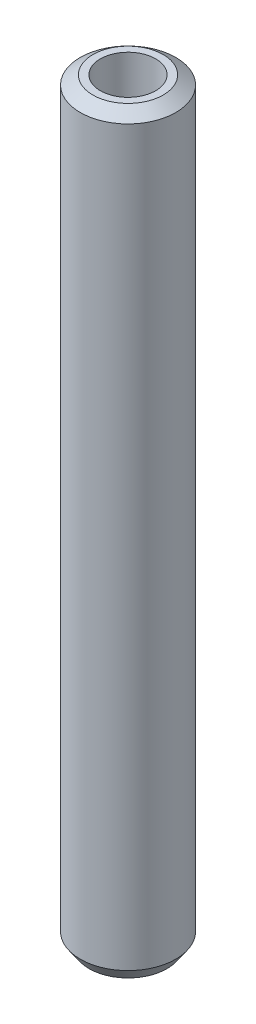
ISO-10303-21;
HEADER;
FILE_DESCRIPTION(('STEP AP214'),'2;1');
FILE_NAME('part.step','',(''),(''),'','','');
FILE_SCHEMA(('AUTOMOTIVE_DESIGN { 1 0 10303 214 1 1 1 1 }'));
ENDSEC;
DATA;
#1=APPLICATION_CONTEXT('core data for automotive mechanical design processes');
#2=APPLICATION_PROTOCOL_DEFINITION('international standard','automotive_design',2000,#1);
#3=PRODUCT_CONTEXT('',#1,'mechanical');
#4=PRODUCT('Part','Part','',(#3));
#5=PRODUCT_RELATED_PRODUCT_CATEGORY('part','',(#4));
#6=PRODUCT_DEFINITION_FORMATION('','',#4);
#7=PRODUCT_DEFINITION_CONTEXT('part definition',#1,'design');
#8=PRODUCT_DEFINITION('design','',#6,#7);
#9=PRODUCT_DEFINITION_SHAPE('','',#8);
#10=(LENGTH_UNIT() NAMED_UNIT(*) SI_UNIT(.MILLI.,.METRE.));
#11=(NAMED_UNIT(*) PLANE_ANGLE_UNIT() SI_UNIT($,.RADIAN.));
#12=(NAMED_UNIT(*) SI_UNIT($,.STERADIAN.) SOLID_ANGLE_UNIT());
#13=UNCERTAINTY_MEASURE_WITH_UNIT(LENGTH_MEASURE(1.E-05),#10,'distance_accuracy_value','');
#14=(GEOMETRIC_REPRESENTATION_CONTEXT(3) GLOBAL_UNCERTAINTY_ASSIGNED_CONTEXT((#13)) GLOBAL_UNIT_ASSIGNED_CONTEXT((#10,
#11,#12)) REPRESENTATION_CONTEXT('',''));
#15=CARTESIAN_POINT('',(0.,0.,0.));
#16=DIRECTION('',(0.,0.,1.));
#17=DIRECTION('',(1.,0.,0.));
#18=AXIS2_PLACEMENT_3D('',#15,#16,#17);
#19=CARTESIAN_POINT('',(0.,197.476012914103,0.));
#20=DIRECTION('',(0.,-1.,0.));
#21=DIRECTION('',(0.,0.,-1.));
#22=AXIS2_PLACEMENT_3D('',#19,#20,#21);
#23=CYLINDRICAL_SURFACE('',#22,12.5);
#24=CARTESIAN_POINT('',(0.,195.169636921624,0.));
#25=DIRECTION('',(0.,1.,0.));
#26=DIRECTION('',(0.,0.,1.));
#27=AXIS2_PLACEMENT_3D('',#24,#25,#26);
#28=CIRCLE('',#27,12.5);
#29=CARTESIAN_POINT('',(0.,195.169636921624,-12.5));
#30=VERTEX_POINT('',#29);
#31=EDGE_CURVE('E50',#30,#30,#28,.F.);
#32=CARTESIAN_POINT('',(0.,3.31130484003073,0.));
#33=DIRECTION('',(0.,1.,0.));
#34=DIRECTION('',(0.,0.,1.));
#35=AXIS2_PLACEMENT_3D('',#32,#33,#34);
#36=CIRCLE('',#35,12.5);
#37=CARTESIAN_POINT('',(0.,3.31130484003073,-12.5));
#38=VERTEX_POINT('',#37);
#39=EDGE_CURVE('E51',#38,#38,#36,.T.);
#40=CARTESIAN_POINT('',(0.,195.169636921624,-12.5));
#41=CARTESIAN_POINT('',(0.,193.171112629107,-12.5));
#42=CARTESIAN_POINT('',(0.,191.172588336591,-12.5));
#43=CARTESIAN_POINT('',(0.,187.175539751557,-12.5));
#44=CARTESIAN_POINT('',(0.,185.177015459041,-12.5));
#45=CARTESIAN_POINT('',(0.,181.179966874008,-12.5));
#46=CARTESIAN_POINT('',(0.,179.181442581491,-12.5));
#47=CARTESIAN_POINT('',(0.,175.184393996458,-12.5));
#48=CARTESIAN_POINT('',(0.,173.185869703941,-12.5));
#49=CARTESIAN_POINT('',(0.,169.188821118908,-12.5));
#50=CARTESIAN_POINT('',(0.,167.190296826391,-12.5));
#51=CARTESIAN_POINT('',(0.,163.193248241358,-12.5));
#52=CARTESIAN_POINT('',(0.,161.194723948842,-12.5));
#53=CARTESIAN_POINT('',(0.,157.197675363808,-12.5));
#54=CARTESIAN_POINT('',(0.,155.199151071292,-12.5));
#55=CARTESIAN_POINT('',(0.,151.202102486259,-12.5));
#56=CARTESIAN_POINT('',(0.,149.203578193742,-12.5));
#57=CARTESIAN_POINT('',(0.,145.206529608709,-12.5));
#58=CARTESIAN_POINT('',(0.,143.208005316192,-12.5));
#59=CARTESIAN_POINT('',(0.,139.210956731159,-12.5));
#60=CARTESIAN_POINT('',(0.,137.212432438643,-12.5));
#61=CARTESIAN_POINT('',(0.,133.215383853609,-12.5));
#62=CARTESIAN_POINT('',(0.,131.216859561093,-12.5));
#63=CARTESIAN_POINT('',(0.,127.21981097606,-12.5));
#64=CARTESIAN_POINT('',(0.,125.221286683543,-12.5));
#65=CARTESIAN_POINT('',(0.,121.22423809851,-12.5));
#66=CARTESIAN_POINT('',(0.,119.225713805993,-12.5));
#67=CARTESIAN_POINT('',(0.,115.22866522096,-12.5));
#68=CARTESIAN_POINT('',(0.,113.230140928443,-12.5));
#69=CARTESIAN_POINT('',(0.,109.23309234341,-12.5));
#70=CARTESIAN_POINT('',(0.,107.234568050894,-12.5));
#71=CARTESIAN_POINT('',(0.,103.23751946586,-12.5));
#72=CARTESIAN_POINT('',(0.,101.238995173344,-12.5));
#73=CARTESIAN_POINT('',(0.,97.2419465883106,-12.5));
#74=CARTESIAN_POINT('',(0.,95.243422295794,-12.5));
#75=CARTESIAN_POINT('',(0.,91.2463737107608,-12.5));
#76=CARTESIAN_POINT('',(0.,89.2478494182442,-12.5));
#77=CARTESIAN_POINT('',(0.,85.2508008332111,-12.5));
#78=CARTESIAN_POINT('',(0.,83.2522765406945,-12.5));
#79=CARTESIAN_POINT('',(0.,79.2552279556613,-12.5));
#80=CARTESIAN_POINT('',(0.,77.2567036631447,-12.5));
#81=CARTESIAN_POINT('',(0.,73.2596550781115,-12.5));
#82=CARTESIAN_POINT('',(0.,71.2611307855949,-12.5));
#83=CARTESIAN_POINT('',(0.,67.2640822005617,-12.5));
#84=CARTESIAN_POINT('',(0.,65.2655579080451,-12.5));
#85=CARTESIAN_POINT('',(0.,61.2685093230119,-12.5));
#86=CARTESIAN_POINT('',(0.,59.2699850304953,-12.5));
#87=CARTESIAN_POINT('',(0.,55.2729364454621,-12.5));
#88=CARTESIAN_POINT('',(0.,53.2744121529456,-12.5));
#89=CARTESIAN_POINT('',(0.,49.2773635679124,-12.5));
#90=CARTESIAN_POINT('',(0.,47.2788392753958,-12.5));
#91=CARTESIAN_POINT('',(0.,43.2817906903626,-12.5));
#92=CARTESIAN_POINT('',(0.,41.283266397846,-12.5));
#93=CARTESIAN_POINT('',(0.,37.2862178128128,-12.5));
#94=CARTESIAN_POINT('',(0.,35.2876935202962,-12.5));
#95=CARTESIAN_POINT('',(0.,31.290644935263,-12.5));
#96=CARTESIAN_POINT('',(0.,29.2921206427464,-12.5));
#97=CARTESIAN_POINT('',(0.,25.2950720577132,-12.5));
#98=CARTESIAN_POINT('',(0.,23.2965477651966,-12.5));
#99=CARTESIAN_POINT('',(0.,19.2994991801635,-12.5));
#100=CARTESIAN_POINT('',(0.,17.3009748876469,-12.5));
#101=CARTESIAN_POINT('',(0.,13.3039263026137,-12.5));
#102=CARTESIAN_POINT('',(0.,11.3054020100971,-12.5));
#103=CARTESIAN_POINT('',(0.,7.3083534250639,-12.5));
#104=CARTESIAN_POINT('',(0.,5.30982913254731,-12.5));
#105=CARTESIAN_POINT('',(0.,3.31130484003073,-12.5));
#106=B_SPLINE_CURVE_WITH_KNOTS('',3,(#40,#41,#42,#43,#44,#45,#46,#47,#48,#49,#50,#51,#52,#53,
#54,#55,#56,#57,#58,#59,#60,#61,#62,#63,#64,#65,#66,#67,#68,#69,#70,#71,#72,#73,#74,#75,#76,#77,
#78,#79,#80,#81,#82,#83,#84,#85,#86,#87,#88,#89,#90,#91,#92,#93,#94,#95,#96,#97,#98,#99,#100,
#101,#102,#103,#104,#105),.UNSPECIFIED.,.F.,.F.,(4,2,2,2,2,2,2,2,2,2,2,2,2,2,2,2,2,2,2,2,2,2,2,
2,2,2,2,2,2,2,2,2,4),(0.,5.99557287754979,11.9911457550996,17.9867186326494,23.9822915101992,
29.9778643877489,35.9734372652987,41.9690101428485,47.9645830203983,53.960155897948,
59.9557287754978,65.9513016530476,71.9468745305974,77.9424474081472,83.938020285697,
89.9335931632467,95.9291660407965,101.924738918346,107.920311795896,113.915884673446,
119.911457550996,125.907030428545,131.902603306095,137.898176183645,143.893749061195,
149.889321938745,155.884894816294,161.880467693844,167.876040571394,173.871613448944,
179.867186326493,185.862759204043,191.858332081593),.UNSPECIFIED.);
#107=EDGE_CURVE('BSEAM39',#30,#38,#106,.T.);
#108=ORIENTED_EDGE('',*,*,#31,.T.);
#109=ORIENTED_EDGE('',*,*,#39,.T.);
#110=ORIENTED_EDGE('',*,*,#107,.T.);
#111=ORIENTED_EDGE('',*,*,#107,.F.);
#112=EDGE_LOOP('',(#108,#110,#109,#111));
#113=FACE_BOUND('',#112,.T.);
#114=ADVANCED_FACE('F39',(#113),#23,.T.);
#115=CARTESIAN_POINT('',(0.,197.476012914103,0.));
#116=DIRECTION('',(0.,1.,0.));
#117=DIRECTION('',(0.,0.,1.));
#118=AXIS2_PLACEMENT_3D('',#115,#116,#117);
#119=PLANE('',#118);
#120=CARTESIAN_POINT('',(0.,197.476012914103,0.));
#121=DIRECTION('',(0.,1.,0.));
#122=DIRECTION('',(0.,0.,1.));
#123=AXIS2_PLACEMENT_3D('',#120,#121,#122);
#124=CIRCLE('',#123,9.18869515996967);
#125=CARTESIAN_POINT('',(0.,197.476012914103,9.18869515996967));
#126=VERTEX_POINT('',#125);
#127=EDGE_CURVE('E54',#126,#126,#124,.T.);
#128=ORIENTED_EDGE('',*,*,#127,.T.);
#129=EDGE_LOOP('',(#128));
#130=FACE_BOUND('',#129,.T.);
#131=CARTESIAN_POINT('',(0.,197.476012914103,0.));
#132=DIRECTION('',(0.,1.,0.));
#133=DIRECTION('',(0.,0.,1.));
#134=AXIS2_PLACEMENT_3D('',#131,#132,#133);
#135=CIRCLE('',#134,7.23894192214689);
#136=CARTESIAN_POINT('',(0.,197.476012914103,-7.23894192214689));
#137=VERTEX_POINT('',#136);
#138=EDGE_CURVE('E58',#137,#137,#135,.T.);
#139=ORIENTED_EDGE('',*,*,#138,.F.);
#140=EDGE_LOOP('',(#139));
#141=FACE_BOUND('',#140,.T.);
#142=ADVANCED_FACE('F69',(#130,#141),#119,.T.);
#143=CARTESIAN_POINT('',(0.,0.,0.));
#144=DIRECTION('',(0.,1.,0.));
#145=DIRECTION('',(0.,0.,1.));
#146=AXIS2_PLACEMENT_3D('',#143,#144,#145);
#147=PLANE('',#146);
#148=CARTESIAN_POINT('',(0.,0.,0.));
#149=DIRECTION('',(0.,1.,0.));
#150=DIRECTION('',(0.,0.,1.));
#151=AXIS2_PLACEMENT_3D('',#148,#149,#150);
#152=CIRCLE('',#151,10.1936240075203);
#153=CARTESIAN_POINT('',(0.,0.,10.1936240075203));
#154=VERTEX_POINT('',#153);
#155=EDGE_CURVE('E10',#154,#154,#152,.F.);
#156=ORIENTED_EDGE('',*,*,#155,.T.);
#157=EDGE_LOOP('',(#156));
#158=FACE_BOUND('',#157,.T.);
#159=CARTESIAN_POINT('',(0.,0.,0.));
#160=DIRECTION('',(0.,1.,0.));
#161=DIRECTION('',(0.,0.,1.));
#162=AXIS2_PLACEMENT_3D('',#159,#160,#161);
#163=CIRCLE('',#162,7.23894192214689);
#164=CARTESIAN_POINT('',(0.,0.,-7.23894192214689));
#165=VERTEX_POINT('',#164);
#166=EDGE_CURVE('E63',#165,#165,#163,.T.);
#167=ORIENTED_EDGE('',*,*,#166,.T.);
#168=EDGE_LOOP('',(#167));
#169=FACE_BOUND('',#168,.T.);
#170=ADVANCED_FACE('F75',(#158,#169),#147,.F.);
#171=CARTESIAN_POINT('',(0.,197.476012914103,0.));
#172=DIRECTION('',(0.,-1.,0.));
#173=DIRECTION('',(0.,0.,-1.));
#174=AXIS2_PLACEMENT_3D('',#171,#172,#173);
#175=CYLINDRICAL_SURFACE('',#174,7.23894192214689);
#176=CARTESIAN_POINT('',(0.,197.476012914103,-7.23894192214689));
#177=CARTESIAN_POINT('',(0.,195.418971112915,-7.23894192214689));
#178=CARTESIAN_POINT('',(0.,193.361929311726,-7.23894192214689));
#179=CARTESIAN_POINT('',(0.,189.247845709349,-7.23894192214689));
#180=CARTESIAN_POINT('',(0.,187.19080390816,-7.23894192214689));
#181=CARTESIAN_POINT('',(0.,183.076720305783,-7.23894192214689));
#182=CARTESIAN_POINT('',(0.,181.019678504595,-7.23894192214689));
#183=CARTESIAN_POINT('',(0.,176.905594902217,-7.23894192214689));
#184=CARTESIAN_POINT('',(0.,174.848553101029,-7.23894192214689));
#185=CARTESIAN_POINT('',(0.,170.734469498652,-7.23894192214689));
#186=CARTESIAN_POINT('',(0.,168.677427697463,-7.23894192214689));
#187=CARTESIAN_POINT('',(0.,164.563344095086,-7.23894192214689));
#188=CARTESIAN_POINT('',(0.,162.506302293897,-7.23894192214689));
#189=CARTESIAN_POINT('',(0.,158.39221869152,-7.23894192214689));
#190=CARTESIAN_POINT('',(0.,156.335176890332,-7.23894192214689));
#191=CARTESIAN_POINT('',(0.,152.221093287954,-7.23894192214689));
#192=CARTESIAN_POINT('',(0.,150.164051486766,-7.23894192214689));
#193=CARTESIAN_POINT('',(0.,146.049967884389,-7.23894192214689));
#194=CARTESIAN_POINT('',(0.,143.9929260832,-7.23894192214689));
#195=CARTESIAN_POINT('',(0.,139.878842480823,-7.23894192214689));
#196=CARTESIAN_POINT('',(0.,137.821800679634,-7.23894192214689));
#197=CARTESIAN_POINT('',(0.,133.707717077257,-7.23894192214689));
#198=CARTESIAN_POINT('',(0.,131.650675276069,-7.23894192214689));
#199=CARTESIAN_POINT('',(0.,127.536591673692,-7.23894192214689));
#200=CARTESIAN_POINT('',(0.,125.479549872503,-7.23894192214689));
#201=CARTESIAN_POINT('',(0.,121.365466270126,-7.23894192214689));
#202=CARTESIAN_POINT('',(0.,119.308424468937,-7.23894192214689));
#203=CARTESIAN_POINT('',(0.,115.19434086656,-7.23894192214689));
#204=CARTESIAN_POINT('',(0.,113.137299065372,-7.23894192214689));
#205=CARTESIAN_POINT('',(0.,109.023215462994,-7.23894192214689));
#206=CARTESIAN_POINT('',(0.,106.966173661806,-7.23894192214689));
#207=CARTESIAN_POINT('',(0.,102.852090059429,-7.23894192214689));
#208=CARTESIAN_POINT('',(0.,100.79504825824,-7.23894192214689));
#209=CARTESIAN_POINT('',(0.,96.680964655863,-7.23894192214689));
#210=CARTESIAN_POINT('',(0.,94.6239228546744,-7.23894192214689));
#211=CARTESIAN_POINT('',(0.,90.5098392522973,-7.23894192214689));
#212=CARTESIAN_POINT('',(0.,88.4527974511087,-7.23894192214689));
#213=CARTESIAN_POINT('',(0.,84.3387138487315,-7.23894192214689));
#214=CARTESIAN_POINT('',(0.,82.281672047543,-7.23894192214689));
#215=CARTESIAN_POINT('',(0.,78.1675884451658,-7.23894192214689));
#216=CARTESIAN_POINT('',(0.,76.1105466439772,-7.23894192214689));
#217=CARTESIAN_POINT('',(0.,71.9964630416001,-7.23894192214689));
#218=CARTESIAN_POINT('',(0.,69.9394212404115,-7.23894192214689));
#219=CARTESIAN_POINT('',(0.,65.8253376380344,-7.23894192214689));
#220=CARTESIAN_POINT('',(0.,63.7682958368458,-7.23894192214689));
#221=CARTESIAN_POINT('',(0.,59.6542122344687,-7.23894192214689));
#222=CARTESIAN_POINT('',(0.,57.5971704332801,-7.23894192214689));
#223=CARTESIAN_POINT('',(0.,53.4830868309029,-7.23894192214689));
#224=CARTESIAN_POINT('',(0.,51.4260450297144,-7.23894192214689));
#225=CARTESIAN_POINT('',(0.,47.3119614273372,-7.23894192214689));
#226=CARTESIAN_POINT('',(0.,45.2549196261486,-7.23894192214689));
#227=CARTESIAN_POINT('',(0.,41.1408360237715,-7.23894192214689));
#228=CARTESIAN_POINT('',(0.,39.0837942225829,-7.23894192214689));
#229=CARTESIAN_POINT('',(0.,34.9697106202058,-7.23894192214689));
#230=CARTESIAN_POINT('',(0.,32.9126688190172,-7.23894192214689));
#231=CARTESIAN_POINT('',(0.,28.79858521664,-7.23894192214689));
#232=CARTESIAN_POINT('',(0.,26.7415434154515,-7.23894192214689));
#233=CARTESIAN_POINT('',(0.,22.6274598130743,-7.23894192214689));
#234=CARTESIAN_POINT('',(0.,20.5704180118857,-7.23894192214689));
#235=CARTESIAN_POINT('',(0.,16.4563344095086,-7.23894192214689));
#236=CARTESIAN_POINT('',(0.,14.39929260832,-7.23894192214689));
#237=CARTESIAN_POINT('',(0.,10.2852090059429,-7.23894192214689));
#238=CARTESIAN_POINT('',(0.,8.22816720475431,-7.23894192214689));
#239=CARTESIAN_POINT('',(0.,4.11408360237716,-7.23894192214689));
#240=CARTESIAN_POINT('',(0.,2.05704180118858,-7.23894192214689));
#241=CARTESIAN_POINT('',(0.,0.,-7.23894192214689));
#242=B_SPLINE_CURVE_WITH_KNOTS('',3,(#176,#177,#178,#179,#180,#181,#182,#183,#184,#185,#186,
#187,#188,#189,#190,#191,#192,#193,#194,#195,#196,#197,#198,#199,#200,#201,#202,#203,#204,#205,
#206,#207,#208,#209,#210,#211,#212,#213,#214,#215,#216,#217,#218,#219,#220,#221,#222,#223,#224,
#225,#226,#227,#228,#229,#230,#231,#232,#233,#234,#235,#236,#237,#238,#239,#240,#241),
.UNSPECIFIED.,.F.,.F.,(4,2,2,2,2,2,2,2,2,2,2,2,2,2,2,2,2,2,2,2,2,2,2,2,2,2,2,2,2,2,2,2,4),(0.,
6.17112540356574,12.3422508071315,18.5133762106972,24.6845016142629,30.8556270178286,
37.0267524213944,43.1978778249601,49.3690032285258,55.5401286320915,61.7112540356572,
67.882379439223,74.0535048427887,80.2246302463544,86.3957556499201,92.5668810534859,
98.7380064570516,104.909131860617,111.080257264183,117.251382667749,123.422508071314,
129.59363347488,135.764758878446,141.935884282012,148.107009685577,154.278135089143,
160.449260492709,166.620385896275,172.79151129984,178.962636703406,185.133762106972,
191.304887510537,197.476012914103),.UNSPECIFIED.);
#243=EDGE_CURVE('BSEAM70',#137,#165,#242,.T.);
#244=ORIENTED_EDGE('',*,*,#138,.T.);
#245=ORIENTED_EDGE('',*,*,#166,.F.);
#246=ORIENTED_EDGE('',*,*,#243,.T.);
#247=ORIENTED_EDGE('',*,*,#243,.F.);
#248=EDGE_LOOP('',(#244,#246,#245,#247));
#249=FACE_BOUND('',#248,.T.);
#250=ADVANCED_FACE('F70',(#249),#175,.F.);
#251=CARTESIAN_POINT('',(0.,197.476012914103,0.));
#252=DIRECTION('',(0.,-1.,0.));
#253=DIRECTION('',(0.,0.,-1.));
#254=AXIS2_PLACEMENT_3D('',#251,#252,#253);
#255=CONICAL_SURFACE('',#254,9.18869515996967,0.962412611241167);
#256=ORIENTED_EDGE('',*,*,#31,.F.);
#257=EDGE_LOOP('',(#256));
#258=FACE_BOUND('',#257,.T.);
#259=ORIENTED_EDGE('',*,*,#127,.F.);
#260=EDGE_LOOP('',(#259));
#261=FACE_BOUND('',#260,.T.);
#262=ADVANCED_FACE('F81',(#258,#261),#255,.T.);
#263=CARTESIAN_POINT('',(0.,3.31130484003073,0.));
#264=DIRECTION('',(0.,1.,0.));
#265=DIRECTION('',(0.,0.,1.));
#266=AXIS2_PLACEMENT_3D('',#263,#264,#265);
#267=CONICAL_SURFACE('',#266,12.5,0.608383715553725);
#268=ORIENTED_EDGE('',*,*,#155,.F.);
#269=EDGE_LOOP('',(#268));
#270=FACE_BOUND('',#269,.T.);
#271=ORIENTED_EDGE('',*,*,#39,.F.);
#272=EDGE_LOOP('',(#271));
#273=FACE_BOUND('',#272,.T.);
#274=ADVANCED_FACE('F45',(#270,#273),#267,.T.);
#275=CLOSED_SHELL('',(#114,#142,#170,#250,#262,#274));
#276=MANIFOLD_SOLID_BREP('B2',#275);
#277=ADVANCED_BREP_SHAPE_REPRESENTATION('',(#18,#276),#14);
#278=SHAPE_DEFINITION_REPRESENTATION(#9,#277);
ENDSEC;
END-ISO-10303-21;
